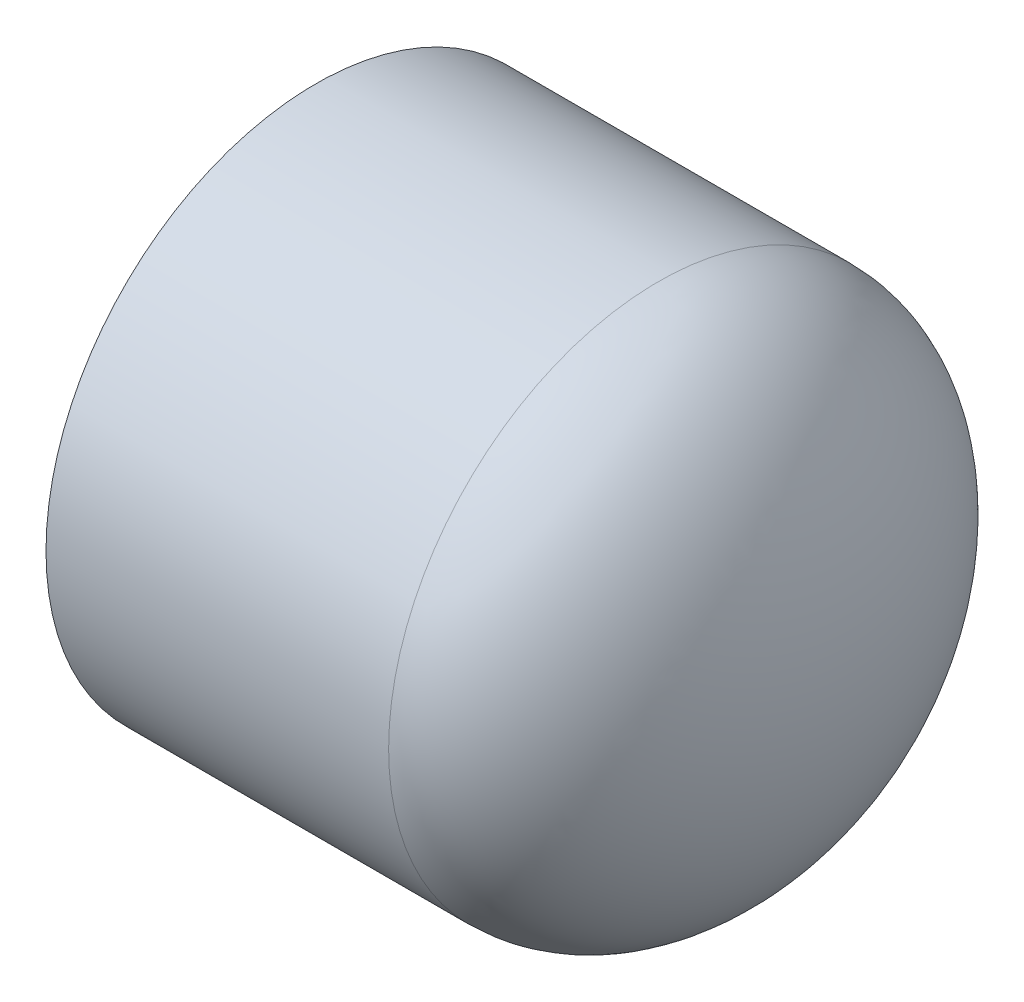
ISO-10303-21;
HEADER;
FILE_DESCRIPTION(('STEP AP214'),'2;1');
FILE_NAME('part.step','',(''),(''),'','','');
FILE_SCHEMA(('AUTOMOTIVE_DESIGN { 1 0 10303 214 1 1 1 1 }'));
ENDSEC;
DATA;
#1=APPLICATION_CONTEXT('core data for automotive mechanical design processes');
#2=APPLICATION_PROTOCOL_DEFINITION('international standard','automotive_design',2000,#1);
#3=PRODUCT_CONTEXT('',#1,'mechanical');
#4=PRODUCT('Part','Part','',(#3));
#5=PRODUCT_RELATED_PRODUCT_CATEGORY('part','',(#4));
#6=PRODUCT_DEFINITION_FORMATION('','',#4);
#7=PRODUCT_DEFINITION_CONTEXT('part definition',#1,'design');
#8=PRODUCT_DEFINITION('design','',#6,#7);
#9=PRODUCT_DEFINITION_SHAPE('','',#8);
#10=(LENGTH_UNIT() NAMED_UNIT(*) SI_UNIT(.MILLI.,.METRE.));
#11=(NAMED_UNIT(*) PLANE_ANGLE_UNIT() SI_UNIT($,.RADIAN.));
#12=(NAMED_UNIT(*) SI_UNIT($,.STERADIAN.) SOLID_ANGLE_UNIT());
#13=UNCERTAINTY_MEASURE_WITH_UNIT(LENGTH_MEASURE(1.E-05),#10,'distance_accuracy_value','');
#14=(GEOMETRIC_REPRESENTATION_CONTEXT(3) GLOBAL_UNCERTAINTY_ASSIGNED_CONTEXT((#13)) GLOBAL_UNIT_ASSIGNED_CONTEXT((#10,
#11,#12)) REPRESENTATION_CONTEXT('',''));
#15=CARTESIAN_POINT('',(0.,0.,0.));
#16=DIRECTION('',(0.,0.,1.));
#17=DIRECTION('',(1.,0.,0.));
#18=AXIS2_PLACEMENT_3D('',#15,#16,#17);
#19=CARTESIAN_POINT('',(-23.8125,0.,0.));
#20=DIRECTION('',(-1.,0.,0.));
#21=DIRECTION('',(0.,0.,1.));
#22=AXIS2_PLACEMENT_3D('',#19,#20,#21);
#23=CYLINDRICAL_SURFACE('',#22,25.003125);
#24=CARTESIAN_POINT('',(7.93750000000001,0.,0.));
#25=DIRECTION('',(-1.,0.,0.));
#26=DIRECTION('',(0.,0.,1.));
#27=AXIS2_PLACEMENT_3D('',#24,#25,#26);
#28=CIRCLE('',#27,25.003125);
#29=CARTESIAN_POINT('',(7.93750000000001,0.,25.003125));
#30=VERTEX_POINT('',#29);
#31=EDGE_CURVE('E11',#30,#30,#28,.T.);
#32=ORIENTED_EDGE('',*,*,#31,.T.);
#33=EDGE_LOOP('',(#32));
#34=FACE_BOUND('',#33,.T.);
#35=CARTESIAN_POINT('',(-23.8125,0.,0.));
#36=DIRECTION('',(-1.,0.,0.));
#37=DIRECTION('',(0.,0.,1.));
#38=AXIS2_PLACEMENT_3D('',#35,#36,#37);
#39=CIRCLE('',#38,25.003125);
#40=CARTESIAN_POINT('',(-23.8125,0.,25.003125));
#41=VERTEX_POINT('',#40);
#42=EDGE_CURVE('E55',#41,#41,#39,.T.);
#43=ORIENTED_EDGE('',*,*,#42,.F.);
#44=EDGE_LOOP('',(#43));
#45=FACE_BOUND('',#44,.T.);
#46=ADVANCED_FACE('F32',(#34,#45),#23,.T.);
#47=CARTESIAN_POINT('',(7.93750000000001,0.,0.));
#48=DIRECTION('',(0.,0.,1.));
#49=DIRECTION('',(0.,1.,0.));
#50=AXIS2_PLACEMENT_3D('',#47,#48,#49);
#51=ELLIPSE('',#50,25.003125,15.875);
#52=TRIMMED_CURVE('',#51,(PARAMETER_VALUE(1.5707963267949)),(PARAMETER_VALUE(4.71238898038469)),
.T.,.PARAMETER.);
#53=CARTESIAN_POINT('',(-23.8125,0.,0.));
#54=DIRECTION('',(-1.,0.,0.));
#55=AXIS1_PLACEMENT('',#53,#54);
#56=SURFACE_OF_REVOLUTION('',#52,#55);
#57=CARTESIAN_POINT('',(23.8125,0.,0.));
#58=VERTEX_POINT('',#57);
#59=VERTEX_LOOP('',#58);
#60=FACE_BOUND('',#59,.T.);
#61=ORIENTED_EDGE('',*,*,#31,.F.);
#62=EDGE_LOOP('',(#61));
#63=FACE_BOUND('',#62,.T.);
#64=ADVANCED_FACE('F45',(#60,#63),#56,.F.);
#65=CARTESIAN_POINT('',(7.93750000000001,0.,0.));
#66=DIRECTION('',(0.,0.,-1.));
#67=DIRECTION('',(0.,-1.,0.));
#68=AXIS2_PLACEMENT_3D('',#65,#66,#67);
#69=ELLIPSE('',#68,21.0185,11.890375);
#70=TRIMMED_CURVE('',#69,(PARAMETER_VALUE(4.71238898038469)),
(PARAMETER_VALUE(7.85398163397448)),.T.,.PARAMETER.);
#71=CARTESIAN_POINT('',(-23.8125,0.,0.));
#72=DIRECTION('',(-1.,0.,0.));
#73=AXIS1_PLACEMENT('',#71,#72);
#74=SURFACE_OF_REVOLUTION('',#70,#73);
#75=CARTESIAN_POINT('',(7.93750000000001,0.,0.));
#76=DIRECTION('',(-1.,0.,0.));
#77=DIRECTION('',(0.,0.,1.));
#78=AXIS2_PLACEMENT_3D('',#75,#76,#77);
#79=CIRCLE('',#78,21.0185);
#80=CARTESIAN_POINT('',(7.93750000000001,0.,21.0185));
#81=VERTEX_POINT('',#80);
#82=EDGE_CURVE('E39',#81,#81,#79,.T.);
#83=ORIENTED_EDGE('',*,*,#82,.T.);
#84=EDGE_LOOP('',(#83));
#85=FACE_BOUND('',#84,.T.);
#86=CARTESIAN_POINT('',(19.827875,0.,0.));
#87=VERTEX_POINT('',#86);
#88=VERTEX_LOOP('',#87);
#89=FACE_BOUND('',#88,.T.);
#90=ADVANCED_FACE('F48',(#85,#89),#74,.F.);
#91=CARTESIAN_POINT('',(7.93750000000001,0.,0.));
#92=DIRECTION('',(-1.,0.,0.));
#93=DIRECTION('',(0.,0.,1.));
#94=AXIS2_PLACEMENT_3D('',#91,#92,#93);
#95=CONICAL_SURFACE('',#94,21.0185,0.00199999733333977);
#96=CARTESIAN_POINT('',(-23.8125,0.,0.));
#97=DIRECTION('',(-1.,0.,0.));
#98=DIRECTION('',(0.,0.,1.));
#99=AXIS2_PLACEMENT_3D('',#96,#97,#98);
#100=CIRCLE('',#99,21.082);
#101=CARTESIAN_POINT('',(-23.8125,0.,21.082));
#102=VERTEX_POINT('',#101);
#103=EDGE_CURVE('E57',#102,#102,#100,.T.);
#104=ORIENTED_EDGE('',*,*,#103,.T.);
#105=EDGE_LOOP('',(#104));
#106=FACE_BOUND('',#105,.T.);
#107=ORIENTED_EDGE('',*,*,#82,.F.);
#108=EDGE_LOOP('',(#107));
#109=FACE_BOUND('',#108,.T.);
#110=ADVANCED_FACE('F68',(#106,#109),#95,.F.);
#111=CARTESIAN_POINT('',(-23.8125,-25.003125,0.));
#112=DIRECTION('',(-1.,0.,0.));
#113=DIRECTION('',(0.,0.,1.));
#114=AXIS2_PLACEMENT_3D('',#111,#112,#113);
#115=PLANE('',#114);
#116=ORIENTED_EDGE('',*,*,#42,.T.);
#117=EDGE_LOOP('',(#116));
#118=FACE_BOUND('',#117,.T.);
#119=ORIENTED_EDGE('',*,*,#103,.F.);
#120=EDGE_LOOP('',(#119));
#121=FACE_BOUND('',#120,.T.);
#122=ADVANCED_FACE('F70',(#118,#121),#115,.T.);
#123=CLOSED_SHELL('',(#46,#64,#90,#110,#122));
#124=MANIFOLD_SOLID_BREP('B2',#123);
#125=ADVANCED_BREP_SHAPE_REPRESENTATION('',(#18,#124),#14);
#126=SHAPE_DEFINITION_REPRESENTATION(#9,#125);
ENDSEC;
END-ISO-10303-21;
